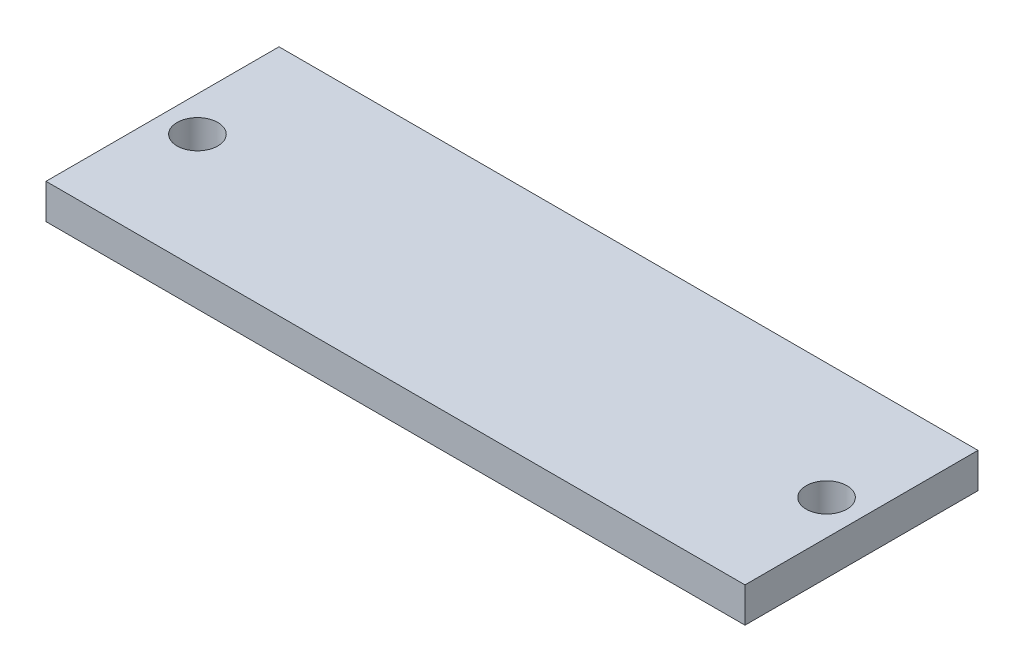
ISO-10303-21;
HEADER;
FILE_DESCRIPTION(('STEP AP214'),'2;1');
FILE_NAME('part.step','',(''),(''),'','','');
FILE_SCHEMA(('AUTOMOTIVE_DESIGN { 1 0 10303 214 1 1 1 1 }'));
ENDSEC;
DATA;
#1=APPLICATION_CONTEXT('core data for automotive mechanical design processes');
#2=APPLICATION_PROTOCOL_DEFINITION('international standard','automotive_design',2000,#1);
#3=PRODUCT_CONTEXT('',#1,'mechanical');
#4=PRODUCT('Part','Part','',(#3));
#5=PRODUCT_RELATED_PRODUCT_CATEGORY('part','',(#4));
#6=PRODUCT_DEFINITION_FORMATION('','',#4);
#7=PRODUCT_DEFINITION_CONTEXT('part definition',#1,'design');
#8=PRODUCT_DEFINITION('design','',#6,#7);
#9=PRODUCT_DEFINITION_SHAPE('','',#8);
#10=(LENGTH_UNIT() NAMED_UNIT(*) SI_UNIT(.MILLI.,.METRE.));
#11=(NAMED_UNIT(*) PLANE_ANGLE_UNIT() SI_UNIT($,.RADIAN.));
#12=(NAMED_UNIT(*) SI_UNIT($,.STERADIAN.) SOLID_ANGLE_UNIT());
#13=UNCERTAINTY_MEASURE_WITH_UNIT(LENGTH_MEASURE(1.E-05),#10,'distance_accuracy_value','');
#14=(GEOMETRIC_REPRESENTATION_CONTEXT(3) GLOBAL_UNCERTAINTY_ASSIGNED_CONTEXT((#13)) GLOBAL_UNIT_ASSIGNED_CONTEXT((#10,
#11,#12)) REPRESENTATION_CONTEXT('',''));
#15=CARTESIAN_POINT('',(0.,0.,0.));
#16=DIRECTION('',(0.,0.,1.));
#17=DIRECTION('',(1.,0.,0.));
#18=AXIS2_PLACEMENT_3D('',#15,#16,#17);
#19=CARTESIAN_POINT('',(-60.,-6.,20.));
#20=DIRECTION('',(-1.,0.,0.));
#21=DIRECTION('',(0.,0.,1.));
#22=AXIS2_PLACEMENT_3D('',#19,#20,#21);
#23=PLANE('',#22);
#24=DIRECTION('',(0.,0.,1.));
#25=VECTOR('',#24,1.);
#26=CARTESIAN_POINT('',(-60.,0.,20.));
#27=LINE('',#26,#25);
#28=CARTESIAN_POINT('',(-60.,0.,-20.));
#29=VERTEX_POINT('',#28);
#30=CARTESIAN_POINT('',(-60.,0.,20.));
#31=VERTEX_POINT('',#30);
#32=EDGE_CURVE('E105',#29,#31,#27,.T.);
#33=ORIENTED_EDGE('',*,*,#32,.F.);
#34=DIRECTION('',(0.,1.,0.));
#35=VECTOR('',#34,1.);
#36=CARTESIAN_POINT('',(-60.,-6.,-20.));
#37=LINE('',#36,#35);
#38=CARTESIAN_POINT('',(-60.,-6.,-20.));
#39=VERTEX_POINT('',#38);
#40=EDGE_CURVE('E11',#39,#29,#37,.T.);
#41=ORIENTED_EDGE('',*,*,#40,.F.);
#42=DIRECTION('',(0.,0.,1.));
#43=VECTOR('',#42,1.);
#44=CARTESIAN_POINT('',(-60.,-6.,20.));
#45=LINE('',#44,#43);
#46=CARTESIAN_POINT('',(-60.,-6.,20.));
#47=VERTEX_POINT('',#46);
#48=EDGE_CURVE('E98',#39,#47,#45,.T.);
#49=ORIENTED_EDGE('',*,*,#48,.T.);
#50=DIRECTION('',(0.,1.,0.));
#51=VECTOR('',#50,1.);
#52=CARTESIAN_POINT('',(-60.,-6.,20.));
#53=LINE('',#52,#51);
#54=EDGE_CURVE('E43',#47,#31,#53,.T.);
#55=ORIENTED_EDGE('',*,*,#54,.T.);
#56=EDGE_LOOP('',(#33,#41,#49,#55));
#57=FACE_BOUND('',#56,.T.);
#58=ADVANCED_FACE('F40',(#57),#23,.T.);
#59=CARTESIAN_POINT('',(60.,-6.,-20.));
#60=DIRECTION('',(0.,0.,-1.));
#61=DIRECTION('',(-1.,0.,0.));
#62=AXIS2_PLACEMENT_3D('',#59,#60,#61);
#63=PLANE('',#62);
#64=DIRECTION('',(-1.,0.,0.));
#65=VECTOR('',#64,1.);
#66=CARTESIAN_POINT('',(60.,0.,-20.));
#67=LINE('',#66,#65);
#68=CARTESIAN_POINT('',(60.,0.,-20.));
#69=VERTEX_POINT('',#68);
#70=EDGE_CURVE('E100',#69,#29,#67,.T.);
#71=ORIENTED_EDGE('',*,*,#70,.F.);
#72=DIRECTION('',(0.,1.,0.));
#73=VECTOR('',#72,1.);
#74=CARTESIAN_POINT('',(60.,-6.,-20.));
#75=LINE('',#74,#73);
#76=CARTESIAN_POINT('',(60.,-6.,-20.));
#77=VERTEX_POINT('',#76);
#78=EDGE_CURVE('E49',#77,#69,#75,.T.);
#79=ORIENTED_EDGE('',*,*,#78,.F.);
#80=DIRECTION('',(-1.,0.,0.));
#81=VECTOR('',#80,1.);
#82=CARTESIAN_POINT('',(60.,-6.,-20.));
#83=LINE('',#82,#81);
#84=EDGE_CURVE('E95',#77,#39,#83,.T.);
#85=ORIENTED_EDGE('',*,*,#84,.T.);
#86=ORIENTED_EDGE('',*,*,#40,.T.);
#87=EDGE_LOOP('',(#71,#79,#85,#86));
#88=FACE_BOUND('',#87,.T.);
#89=ADVANCED_FACE('F116',(#88),#63,.T.);
#90=CARTESIAN_POINT('',(60.,-6.,20.));
#91=DIRECTION('',(1.,0.,0.));
#92=DIRECTION('',(0.,0.,-1.));
#93=AXIS2_PLACEMENT_3D('',#90,#91,#92);
#94=PLANE('',#93);
#95=DIRECTION('',(0.,0.,-1.));
#96=VECTOR('',#95,1.);
#97=CARTESIAN_POINT('',(60.,0.,20.));
#98=LINE('',#97,#96);
#99=CARTESIAN_POINT('',(60.,0.,20.));
#100=VERTEX_POINT('',#99);
#101=EDGE_CURVE('E90',#100,#69,#98,.T.);
#102=ORIENTED_EDGE('',*,*,#101,.F.);
#103=DIRECTION('',(0.,1.,0.));
#104=VECTOR('',#103,1.);
#105=CARTESIAN_POINT('',(60.,-6.,20.));
#106=LINE('',#105,#104);
#107=CARTESIAN_POINT('',(60.,-6.,20.));
#108=VERTEX_POINT('',#107);
#109=EDGE_CURVE('E85',#108,#100,#106,.T.);
#110=ORIENTED_EDGE('',*,*,#109,.F.);
#111=DIRECTION('',(0.,0.,-1.));
#112=VECTOR('',#111,1.);
#113=CARTESIAN_POINT('',(60.,-6.,20.));
#114=LINE('',#113,#112);
#115=EDGE_CURVE('E88',#108,#77,#114,.T.);
#116=ORIENTED_EDGE('',*,*,#115,.T.);
#117=ORIENTED_EDGE('',*,*,#78,.T.);
#118=EDGE_LOOP('',(#102,#110,#116,#117));
#119=FACE_BOUND('',#118,.T.);
#120=ADVANCED_FACE('F87',(#119),#94,.T.);
#121=CARTESIAN_POINT('',(60.,-6.,20.));
#122=DIRECTION('',(0.,0.,1.));
#123=DIRECTION('',(1.,0.,0.));
#124=AXIS2_PLACEMENT_3D('',#121,#122,#123);
#125=PLANE('',#124);
#126=DIRECTION('',(1.,0.,0.));
#127=VECTOR('',#126,1.);
#128=CARTESIAN_POINT('',(60.,0.,20.));
#129=LINE('',#128,#127);
#130=EDGE_CURVE('E108',#31,#100,#129,.T.);
#131=ORIENTED_EDGE('',*,*,#130,.F.);
#132=ORIENTED_EDGE('',*,*,#54,.F.);
#133=DIRECTION('',(1.,0.,0.));
#134=VECTOR('',#133,1.);
#135=CARTESIAN_POINT('',(60.,-6.,20.));
#136=LINE('',#135,#134);
#137=EDGE_CURVE('E94',#47,#108,#136,.T.);
#138=ORIENTED_EDGE('',*,*,#137,.T.);
#139=ORIENTED_EDGE('',*,*,#109,.T.);
#140=EDGE_LOOP('',(#131,#132,#138,#139));
#141=FACE_BOUND('',#140,.T.);
#142=ADVANCED_FACE('F97',(#141),#125,.T.);
#143=CARTESIAN_POINT('',(0.,-6.,0.));
#144=DIRECTION('',(0.,1.,0.));
#145=DIRECTION('',(0.,0.,1.));
#146=AXIS2_PLACEMENT_3D('',#143,#144,#145);
#147=PLANE('',#146);
#148=CARTESIAN_POINT('',(-54.,-6.,0.));
#149=DIRECTION('',(0.,1.,0.));
#150=DIRECTION('',(0.,0.,1.));
#151=AXIS2_PLACEMENT_3D('',#148,#149,#150);
#152=CIRCLE('',#151,3.5);
#153=CARTESIAN_POINT('',(-54.,-6.,3.5));
#154=VERTEX_POINT('',#153);
#155=EDGE_CURVE('E149',#154,#154,#152,.T.);
#156=ORIENTED_EDGE('',*,*,#155,.T.);
#157=EDGE_LOOP('',(#156));
#158=FACE_BOUND('',#157,.T.);
#159=CARTESIAN_POINT('',(54.,-6.,0.));
#160=DIRECTION('',(0.,1.,0.));
#161=DIRECTION('',(0.,0.,1.));
#162=AXIS2_PLACEMENT_3D('',#159,#160,#161);
#163=CIRCLE('',#162,3.5);
#164=CARTESIAN_POINT('',(54.,-6.,3.49999999999999));
#165=VERTEX_POINT('',#164);
#166=EDGE_CURVE('E109',#165,#165,#163,.T.);
#167=ORIENTED_EDGE('',*,*,#166,.T.);
#168=EDGE_LOOP('',(#167));
#169=FACE_BOUND('',#168,.T.);
#170=ORIENTED_EDGE('',*,*,#48,.F.);
#171=ORIENTED_EDGE('',*,*,#84,.F.);
#172=ORIENTED_EDGE('',*,*,#115,.F.);
#173=ORIENTED_EDGE('',*,*,#137,.F.);
#174=EDGE_LOOP('',(#170,#171,#172,#173));
#175=FACE_BOUND('',#174,.T.);
#176=ADVANCED_FACE('F93',(#158,#169,#175),#147,.F.);
#177=CARTESIAN_POINT('',(0.,0.,0.));
#178=DIRECTION('',(0.,1.,0.));
#179=DIRECTION('',(0.,0.,1.));
#180=AXIS2_PLACEMENT_3D('',#177,#178,#179);
#181=PLANE('',#180);
#182=CARTESIAN_POINT('',(-54.,0.,0.));
#183=DIRECTION('',(0.,1.,0.));
#184=DIRECTION('',(0.,0.,1.));
#185=AXIS2_PLACEMENT_3D('',#182,#183,#184);
#186=CIRCLE('',#185,3.5);
#187=CARTESIAN_POINT('',(-54.,0.,3.5));
#188=VERTEX_POINT('',#187);
#189=EDGE_CURVE('E152',#188,#188,#186,.T.);
#190=ORIENTED_EDGE('',*,*,#189,.F.);
#191=EDGE_LOOP('',(#190));
#192=FACE_BOUND('',#191,.T.);
#193=CARTESIAN_POINT('',(54.,0.,0.));
#194=DIRECTION('',(0.,1.,0.));
#195=DIRECTION('',(0.,0.,1.));
#196=AXIS2_PLACEMENT_3D('',#193,#194,#195);
#197=CIRCLE('',#196,3.5);
#198=CARTESIAN_POINT('',(54.,0.,3.5));
#199=VERTEX_POINT('',#198);
#200=EDGE_CURVE('E154',#199,#199,#197,.T.);
#201=ORIENTED_EDGE('',*,*,#200,.F.);
#202=EDGE_LOOP('',(#201));
#203=FACE_BOUND('',#202,.T.);
#204=ORIENTED_EDGE('',*,*,#32,.T.);
#205=ORIENTED_EDGE('',*,*,#130,.T.);
#206=ORIENTED_EDGE('',*,*,#101,.T.);
#207=ORIENTED_EDGE('',*,*,#70,.T.);
#208=EDGE_LOOP('',(#204,#205,#206,#207));
#209=FACE_BOUND('',#208,.T.);
#210=ADVANCED_FACE('F115',(#192,#203,#209),#181,.T.);
#211=CARTESIAN_POINT('',(54.,0.,0.));
#212=DIRECTION('',(0.,1.,0.));
#213=DIRECTION('',(0.,0.,1.));
#214=AXIS2_PLACEMENT_3D('',#211,#212,#213);
#215=CYLINDRICAL_SURFACE('',#214,3.5);
#216=ORIENTED_EDGE('',*,*,#166,.F.);
#217=EDGE_LOOP('',(#216));
#218=FACE_BOUND('',#217,.T.);
#219=ORIENTED_EDGE('',*,*,#200,.T.);
#220=EDGE_LOOP('',(#219));
#221=FACE_BOUND('',#220,.T.);
#222=ADVANCED_FACE('F134',(#218,#221),#215,.F.);
#223=CARTESIAN_POINT('',(-54.,0.,0.));
#224=DIRECTION('',(0.,1.,0.));
#225=DIRECTION('',(0.,0.,1.));
#226=AXIS2_PLACEMENT_3D('',#223,#224,#225);
#227=CYLINDRICAL_SURFACE('',#226,3.5);
#228=ORIENTED_EDGE('',*,*,#155,.F.);
#229=EDGE_LOOP('',(#228));
#230=FACE_BOUND('',#229,.T.);
#231=ORIENTED_EDGE('',*,*,#189,.T.);
#232=EDGE_LOOP('',(#231));
#233=FACE_BOUND('',#232,.T.);
#234=ADVANCED_FACE('F141',(#230,#233),#227,.F.);
#235=CLOSED_SHELL('',(#58,#89,#120,#142,#176,#210,#222,#234));
#236=MANIFOLD_SOLID_BREP('B2',#235);
#237=ADVANCED_BREP_SHAPE_REPRESENTATION('',(#18,#236),#14);
#238=SHAPE_DEFINITION_REPRESENTATION(#9,#237);
ENDSEC;
END-ISO-10303-21;
